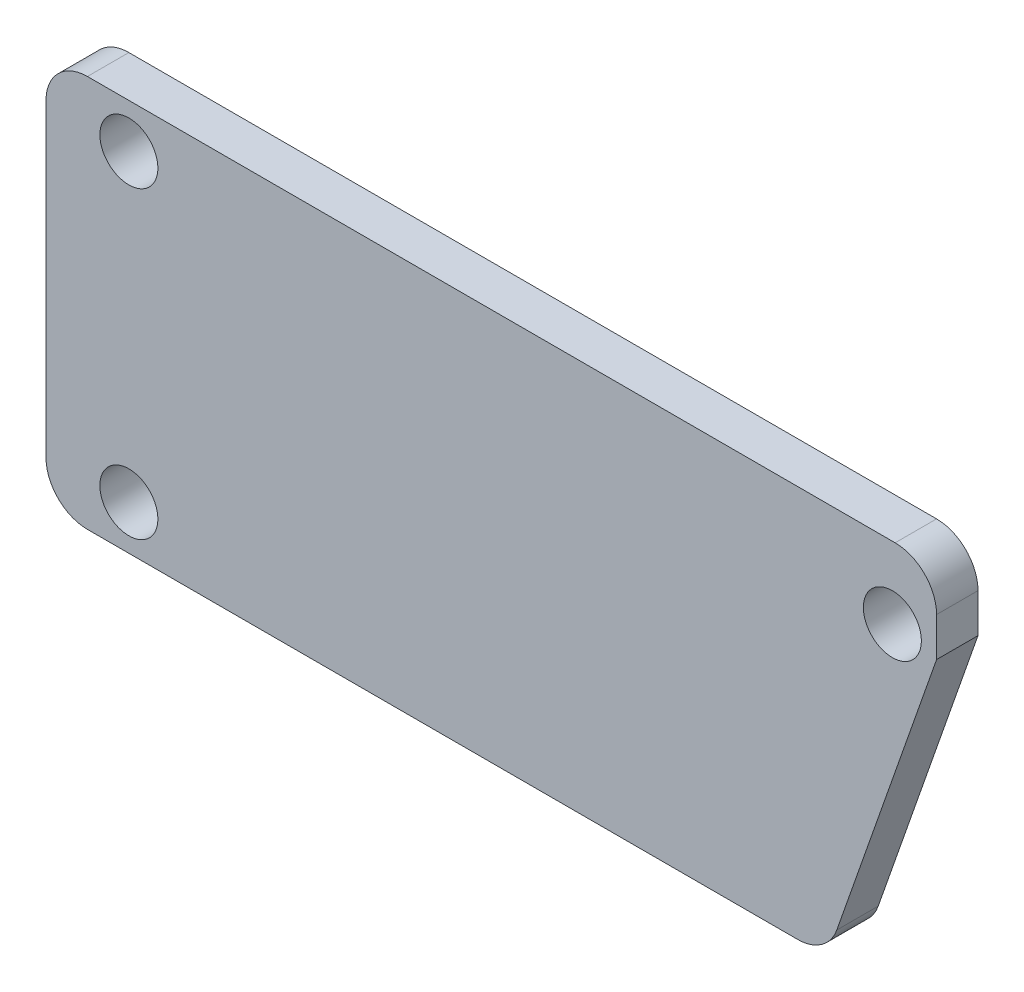
ISO-10303-21;
HEADER;
FILE_DESCRIPTION(('STEP AP214'),'2;1');
FILE_NAME('part.step','',(''),(''),'','','');
FILE_SCHEMA(('AUTOMOTIVE_DESIGN { 1 0 10303 214 1 1 1 1 }'));
ENDSEC;
DATA;
#1=APPLICATION_CONTEXT('core data for automotive mechanical design processes');
#2=APPLICATION_PROTOCOL_DEFINITION('international standard','automotive_design',2000,#1);
#3=PRODUCT_CONTEXT('',#1,'mechanical');
#4=PRODUCT('Part','Part','',(#3));
#5=PRODUCT_RELATED_PRODUCT_CATEGORY('part','',(#4));
#6=PRODUCT_DEFINITION_FORMATION('','',#4);
#7=PRODUCT_DEFINITION_CONTEXT('part definition',#1,'design');
#8=PRODUCT_DEFINITION('design','',#6,#7);
#9=PRODUCT_DEFINITION_SHAPE('','',#8);
#10=(LENGTH_UNIT() NAMED_UNIT(*) SI_UNIT(.MILLI.,.METRE.));
#11=(NAMED_UNIT(*) PLANE_ANGLE_UNIT() SI_UNIT($,.RADIAN.));
#12=(NAMED_UNIT(*) SI_UNIT($,.STERADIAN.) SOLID_ANGLE_UNIT());
#13=UNCERTAINTY_MEASURE_WITH_UNIT(LENGTH_MEASURE(1.E-05),#10,'distance_accuracy_value','');
#14=(GEOMETRIC_REPRESENTATION_CONTEXT(3) GLOBAL_UNCERTAINTY_ASSIGNED_CONTEXT((#13)) GLOBAL_UNIT_ASSIGNED_CONTEXT((#10,
#11,#12)) REPRESENTATION_CONTEXT('',''));
#15=CARTESIAN_POINT('',(0.,0.,0.));
#16=DIRECTION('',(0.,0.,1.));
#17=DIRECTION('',(1.,0.,0.));
#18=AXIS2_PLACEMENT_3D('',#15,#16,#17);
#19=CARTESIAN_POINT('',(0.,0.,0.));
#20=DIRECTION('',(0.,0.,1.));
#21=DIRECTION('',(1.,0.,0.));
#22=AXIS2_PLACEMENT_3D('',#19,#20,#21);
#23=PLANE('',#22);
#24=CARTESIAN_POINT('',(21.6878260869565,5.61253324212658,0.));
#25=DIRECTION('',(0.,0.,1.));
#26=DIRECTION('',(1.,0.,0.));
#27=AXIS2_PLACEMENT_3D('',#24,#25,#26);
#28=CIRCLE('',#27,1.05);
#29=CARTESIAN_POINT('',(22.7378260869565,5.61253324212658,0.));
#30=VERTEX_POINT('',#29);
#31=EDGE_CURVE('E148',#30,#30,#28,.T.);
#32=ORIENTED_EDGE('',*,*,#31,.T.);
#33=EDGE_LOOP('',(#32));
#34=FACE_BOUND('',#33,.T.);
#35=CARTESIAN_POINT('',(-5.95217391304348,6.61253324212658,0.));
#36=DIRECTION('',(0.,0.,1.));
#37=DIRECTION('',(-1.,0.,0.));
#38=AXIS2_PLACEMENT_3D('',#35,#36,#37);
#39=CIRCLE('',#38,1.05);
#40=CARTESIAN_POINT('',(-7.00217391304348,6.61253324212658,0.));
#41=VERTEX_POINT('',#40);
#42=EDGE_CURVE('E158',#41,#41,#39,.T.);
#43=ORIENTED_EDGE('',*,*,#42,.T.);
#44=EDGE_LOOP('',(#43));
#45=FACE_BOUND('',#44,.T.);
#46=CARTESIAN_POINT('',(-5.95217391304348,-4.38746675787342,0.));
#47=DIRECTION('',(0.,0.,1.));
#48=DIRECTION('',(1.,0.,0.));
#49=AXIS2_PLACEMENT_3D('',#46,#47,#48);
#50=CIRCLE('',#49,1.05);
#51=CARTESIAN_POINT('',(-4.90217391304348,-4.38746675787342,0.));
#52=VERTEX_POINT('',#51);
#53=EDGE_CURVE('E163',#52,#52,#50,.T.);
#54=ORIENTED_EDGE('',*,*,#53,.T.);
#55=EDGE_LOOP('',(#54));
#56=FACE_BOUND('',#55,.T.);
#57=DIRECTION('',(0.331357070773526,0.943505427461013,0.));
#58=VECTOR('',#57,1.);
#59=CARTESIAN_POINT('',(19.3231466399224,-5.98746675787342,0.));
#60=LINE('',#59,#58);
#61=CARTESIAN_POINT('',(19.675385571422,-4.98450236403371,0.));
#62=VERTEX_POINT('',#61);
#63=CARTESIAN_POINT('',(23.2878260869565,5.30155317366882,0.));
#64=VERTEX_POINT('',#63);
#65=EDGE_CURVE('E193',#62,#64,#60,.T.);
#66=ORIENTED_EDGE('',*,*,#65,.F.);
#67=CARTESIAN_POINT('',(18.2601274302304,-4.48746675787342,0.));
#68=DIRECTION('',(0.,0.,1.));
#69=DIRECTION('',(1.,0.,0.));
#70=AXIS2_PLACEMENT_3D('',#67,#68,#69);
#71=CIRCLE('',#70,1.5);
#72=CARTESIAN_POINT('',(18.2601274302304,-5.98746675787342,0.));
#73=VERTEX_POINT('',#72);
#74=EDGE_CURVE('E218',#62,#73,#71,.F.);
#75=ORIENTED_EDGE('',*,*,#74,.T.);
#76=DIRECTION('',(1.,0.,0.));
#77=VECTOR('',#76,1.);
#78=CARTESIAN_POINT('',(-8.95217391304348,-5.98746675787342,0.));
#79=LINE('',#78,#77);
#80=CARTESIAN_POINT('',(-7.45217391304348,-5.98746675787342,0.));
#81=VERTEX_POINT('',#80);
#82=EDGE_CURVE('E190',#81,#73,#79,.T.);
#83=ORIENTED_EDGE('',*,*,#82,.F.);
#84=CARTESIAN_POINT('',(-7.45217391304348,-4.48746675787342,0.));
#85=DIRECTION('',(0.,0.,1.));
#86=DIRECTION('',(1.,0.,0.));
#87=AXIS2_PLACEMENT_3D('',#84,#85,#86);
#88=CIRCLE('',#87,1.5);
#89=CARTESIAN_POINT('',(-8.95217391304348,-4.48746675787342,0.));
#90=VERTEX_POINT('',#89);
#91=EDGE_CURVE('E216',#81,#90,#88,.F.);
#92=ORIENTED_EDGE('',*,*,#91,.T.);
#93=DIRECTION('',(0.,-1.,0.));
#94=VECTOR('',#93,1.);
#95=CARTESIAN_POINT('',(-8.95217391304348,8.21253324212658,0.));
#96=LINE('',#95,#94);
#97=CARTESIAN_POINT('',(-8.95217391304348,6.71253324212658,0.));
#98=VERTEX_POINT('',#97);
#99=EDGE_CURVE('E169',#98,#90,#96,.T.);
#100=ORIENTED_EDGE('',*,*,#99,.F.);
#101=CARTESIAN_POINT('',(-7.45217391304348,6.71253324212658,0.));
#102=DIRECTION('',(0.,0.,1.));
#103=DIRECTION('',(1.,0.,0.));
#104=AXIS2_PLACEMENT_3D('',#101,#102,#103);
#105=CIRCLE('',#104,1.5);
#106=CARTESIAN_POINT('',(-7.45217391304348,8.21253324212658,0.));
#107=VERTEX_POINT('',#106);
#108=EDGE_CURVE('E214',#98,#107,#105,.F.);
#109=ORIENTED_EDGE('',*,*,#108,.T.);
#110=DIRECTION('',(-1.,0.,0.));
#111=VECTOR('',#110,1.);
#112=CARTESIAN_POINT('',(-8.95217391304348,8.21253324212658,0.));
#113=LINE('',#112,#111);
#114=CARTESIAN_POINT('',(21.7878260869565,8.21253324212658,0.));
#115=VERTEX_POINT('',#114);
#116=EDGE_CURVE('E176',#115,#107,#113,.T.);
#117=ORIENTED_EDGE('',*,*,#116,.F.);
#118=CARTESIAN_POINT('',(21.7878260869565,6.71253324212658,0.));
#119=DIRECTION('',(0.,0.,1.));
#120=DIRECTION('',(1.,0.,0.));
#121=AXIS2_PLACEMENT_3D('',#118,#119,#120);
#122=CIRCLE('',#121,1.5);
#123=CARTESIAN_POINT('',(23.2878260869565,6.71253324212658,0.));
#124=VERTEX_POINT('',#123);
#125=EDGE_CURVE('E205',#115,#124,#122,.F.);
#126=ORIENTED_EDGE('',*,*,#125,.T.);
#127=DIRECTION('',(0.,1.,0.));
#128=VECTOR('',#127,1.);
#129=CARTESIAN_POINT('',(23.2878260869565,8.21253324212658,0.));
#130=LINE('',#129,#128);
#131=EDGE_CURVE('E195',#64,#124,#130,.T.);
#132=ORIENTED_EDGE('',*,*,#131,.F.);
#133=EDGE_LOOP('',(#66,#75,#83,#92,#100,#109,#117,#126,#132));
#134=FACE_BOUND('',#133,.T.);
#135=DIRECTION('',(0.,-1.,0.));
#136=VECTOR('',#135,1.);
#137=CARTESIAN_POINT('',(5.20782608695652,2.36253324212658,0.));
#138=LINE('',#137,#136);
#139=CARTESIAN_POINT('',(5.20782608695652,2.36253324212658,0.));
#140=VERTEX_POINT('',#139);
#141=CARTESIAN_POINT('',(5.20782608695652,-0.137466757873424,0.));
#142=VERTEX_POINT('',#141);
#143=EDGE_CURVE('E147',#140,#142,#138,.T.);
#144=ORIENTED_EDGE('',*,*,#143,.F.);
#145=DIRECTION('',(1.,0.,0.));
#146=VECTOR('',#145,1.);
#147=CARTESIAN_POINT('',(5.20782608695652,2.36253324212658,0.));
#148=LINE('',#147,#146);
#149=CARTESIAN_POINT('',(2.70782608695652,2.36253324212658,0.));
#150=VERTEX_POINT('',#149);
#151=EDGE_CURVE('E144',#150,#140,#148,.T.);
#152=ORIENTED_EDGE('',*,*,#151,.F.);
#153=DIRECTION('',(0.,1.,0.));
#154=VECTOR('',#153,1.);
#155=CARTESIAN_POINT('',(2.70782608695652,2.36253324212658,0.));
#156=LINE('',#155,#154);
#157=CARTESIAN_POINT('',(2.70782608695652,-0.137466757873423,0.));
#158=VERTEX_POINT('',#157);
#159=EDGE_CURVE('E53',#158,#150,#156,.T.);
#160=ORIENTED_EDGE('',*,*,#159,.F.);
#161=DIRECTION('',(-1.,0.,0.));
#162=VECTOR('',#161,1.);
#163=CARTESIAN_POINT('',(5.20782608695652,-0.137466757873424,0.));
#164=LINE('',#163,#162);
#165=EDGE_CURVE('E48',#142,#158,#164,.T.);
#166=ORIENTED_EDGE('',*,*,#165,.F.);
#167=EDGE_LOOP('',(#144,#152,#160,#166));
#168=FACE_BOUND('',#167,.T.);
#169=ADVANCED_FACE('F33',(#34,#45,#56,#134,#168),#23,.F.);
#170=CARTESIAN_POINT('',(0.,0.,1.5));
#171=DIRECTION('',(0.,0.,1.));
#172=DIRECTION('',(1.,0.,0.));
#173=AXIS2_PLACEMENT_3D('',#170,#171,#172);
#174=PLANE('',#173);
#175=CARTESIAN_POINT('',(-5.95217391304348,6.61253324212658,1.5));
#176=DIRECTION('',(0.,0.,1.));
#177=DIRECTION('',(-1.,0.,0.));
#178=AXIS2_PLACEMENT_3D('',#175,#176,#177);
#179=CIRCLE('',#178,1.05);
#180=CARTESIAN_POINT('',(-7.00217391304348,6.61253324212658,1.5));
#181=VERTEX_POINT('',#180);
#182=EDGE_CURVE('E160',#181,#181,#179,.T.);
#183=ORIENTED_EDGE('',*,*,#182,.F.);
#184=EDGE_LOOP('',(#183));
#185=FACE_BOUND('',#184,.T.);
#186=DIRECTION('',(1.,0.,0.));
#187=VECTOR('',#186,1.);
#188=CARTESIAN_POINT('',(-8.95217391304348,-5.98746675787342,1.5));
#189=LINE('',#188,#187);
#190=CARTESIAN_POINT('',(-7.45217391304348,-5.98746675787342,1.5));
#191=VERTEX_POINT('',#190);
#192=CARTESIAN_POINT('',(18.2601274302304,-5.98746675787342,1.5));
#193=VERTEX_POINT('',#192);
#194=EDGE_CURVE('E175',#191,#193,#189,.T.);
#195=ORIENTED_EDGE('',*,*,#194,.T.);
#196=CARTESIAN_POINT('',(18.2601274302304,-4.48746675787342,1.5));
#197=DIRECTION('',(0.,0.,1.));
#198=DIRECTION('',(1.,0.,0.));
#199=AXIS2_PLACEMENT_3D('',#196,#197,#198);
#200=CIRCLE('',#199,1.5);
#201=CARTESIAN_POINT('',(19.675385571422,-4.98450236403371,1.5));
#202=VERTEX_POINT('',#201);
#203=EDGE_CURVE('E229',#193,#202,#200,.T.);
#204=ORIENTED_EDGE('',*,*,#203,.T.);
#205=DIRECTION('',(0.331357070773526,0.943505427461013,0.));
#206=VECTOR('',#205,1.);
#207=CARTESIAN_POINT('',(19.3231466399224,-5.98746675787342,1.5));
#208=LINE('',#207,#206);
#209=CARTESIAN_POINT('',(23.2878260869565,5.30155317366882,1.5));
#210=VERTEX_POINT('',#209);
#211=EDGE_CURVE('E179',#202,#210,#208,.T.);
#212=ORIENTED_EDGE('',*,*,#211,.T.);
#213=DIRECTION('',(0.,1.,0.));
#214=VECTOR('',#213,1.);
#215=CARTESIAN_POINT('',(23.2878260869565,8.21253324212658,1.5));
#216=LINE('',#215,#214);
#217=CARTESIAN_POINT('',(23.2878260869565,6.71253324212658,1.5));
#218=VERTEX_POINT('',#217);
#219=EDGE_CURVE('E181',#210,#218,#216,.T.);
#220=ORIENTED_EDGE('',*,*,#219,.T.);
#221=CARTESIAN_POINT('',(21.7878260869565,6.71253324212658,1.5));
#222=DIRECTION('',(0.,0.,1.));
#223=DIRECTION('',(1.,0.,0.));
#224=AXIS2_PLACEMENT_3D('',#221,#222,#223);
#225=CIRCLE('',#224,1.5);
#226=CARTESIAN_POINT('',(21.7878260869565,8.21253324212658,1.5));
#227=VERTEX_POINT('',#226);
#228=EDGE_CURVE('E209',#218,#227,#225,.T.);
#229=ORIENTED_EDGE('',*,*,#228,.T.);
#230=DIRECTION('',(-1.,0.,0.));
#231=VECTOR('',#230,1.);
#232=CARTESIAN_POINT('',(-8.95217391304348,8.21253324212658,1.5));
#233=LINE('',#232,#231);
#234=CARTESIAN_POINT('',(-7.45217391304348,8.21253324212658,1.5));
#235=VERTEX_POINT('',#234);
#236=EDGE_CURVE('E184',#227,#235,#233,.T.);
#237=ORIENTED_EDGE('',*,*,#236,.T.);
#238=CARTESIAN_POINT('',(-7.45217391304348,6.71253324212658,1.5));
#239=DIRECTION('',(0.,0.,1.));
#240=DIRECTION('',(1.,0.,0.));
#241=AXIS2_PLACEMENT_3D('',#238,#239,#240);
#242=CIRCLE('',#241,1.5);
#243=CARTESIAN_POINT('',(-8.95217391304348,6.71253324212658,1.5));
#244=VERTEX_POINT('',#243);
#245=EDGE_CURVE('E225',#235,#244,#242,.T.);
#246=ORIENTED_EDGE('',*,*,#245,.T.);
#247=DIRECTION('',(0.,-1.,0.));
#248=VECTOR('',#247,1.);
#249=CARTESIAN_POINT('',(-8.95217391304348,8.21253324212658,1.5));
#250=LINE('',#249,#248);
#251=CARTESIAN_POINT('',(-8.95217391304348,-4.48746675787342,1.5));
#252=VERTEX_POINT('',#251);
#253=EDGE_CURVE('E172',#244,#252,#250,.T.);
#254=ORIENTED_EDGE('',*,*,#253,.T.);
#255=CARTESIAN_POINT('',(-7.45217391304348,-4.48746675787342,1.5));
#256=DIRECTION('',(0.,0.,1.));
#257=DIRECTION('',(1.,0.,0.));
#258=AXIS2_PLACEMENT_3D('',#255,#256,#257);
#259=CIRCLE('',#258,1.5);
#260=EDGE_CURVE('E227',#252,#191,#259,.T.);
#261=ORIENTED_EDGE('',*,*,#260,.T.);
#262=EDGE_LOOP('',(#195,#204,#212,#220,#229,#237,#246,#254,#261));
#263=FACE_BOUND('',#262,.T.);
#264=CARTESIAN_POINT('',(-5.95217391304348,-4.38746675787342,1.5));
#265=DIRECTION('',(0.,0.,1.));
#266=DIRECTION('',(1.,0.,0.));
#267=AXIS2_PLACEMENT_3D('',#264,#265,#266);
#268=CIRCLE('',#267,1.05);
#269=CARTESIAN_POINT('',(-4.90217391304348,-4.38746675787342,1.5));
#270=VERTEX_POINT('',#269);
#271=EDGE_CURVE('E166',#270,#270,#268,.T.);
#272=ORIENTED_EDGE('',*,*,#271,.F.);
#273=EDGE_LOOP('',(#272));
#274=FACE_BOUND('',#273,.T.);
#275=CARTESIAN_POINT('',(21.6878260869565,5.61253324212658,1.5));
#276=DIRECTION('',(0.,0.,1.));
#277=DIRECTION('',(1.,0.,0.));
#278=AXIS2_PLACEMENT_3D('',#275,#276,#277);
#279=CIRCLE('',#278,1.05);
#280=CARTESIAN_POINT('',(22.7378260869565,5.61253324212658,1.5));
#281=VERTEX_POINT('',#280);
#282=EDGE_CURVE('E151',#281,#281,#279,.T.);
#283=ORIENTED_EDGE('',*,*,#282,.F.);
#284=EDGE_LOOP('',(#283));
#285=FACE_BOUND('',#284,.T.);
#286=ADVANCED_FACE('F242',(#185,#263,#274,#285),#174,.T.);
#287=CARTESIAN_POINT('',(-8.95217391304348,8.21253324212658,1.5));
#288=DIRECTION('',(1.,0.,0.));
#289=DIRECTION('',(0.,0.,-1.));
#290=AXIS2_PLACEMENT_3D('',#287,#288,#289);
#291=PLANE('',#290);
#292=ORIENTED_EDGE('',*,*,#99,.T.);
#293=DIRECTION('',(0.,0.,-1.));
#294=VECTOR('',#293,1.);
#295=CARTESIAN_POINT('',(-8.95217391304348,-4.48746675787342,1.5));
#296=LINE('',#295,#294);
#297=EDGE_CURVE('E41',#90,#252,#296,.F.);
#298=ORIENTED_EDGE('',*,*,#297,.T.);
#299=ORIENTED_EDGE('',*,*,#253,.F.);
#300=DIRECTION('',(0.,0.,-1.));
#301=VECTOR('',#300,1.);
#302=CARTESIAN_POINT('',(-8.95217391304348,6.71253324212658,1.5));
#303=LINE('',#302,#301);
#304=EDGE_CURVE('E231',#244,#98,#303,.T.);
#305=ORIENTED_EDGE('',*,*,#304,.T.);
#306=EDGE_LOOP('',(#292,#298,#299,#305));
#307=FACE_BOUND('',#306,.T.);
#308=ADVANCED_FACE('F236',(#307),#291,.F.);
#309=CARTESIAN_POINT('',(-8.95217391304348,-5.98746675787342,1.5));
#310=DIRECTION('',(0.,1.,0.));
#311=DIRECTION('',(0.,0.,1.));
#312=AXIS2_PLACEMENT_3D('',#309,#310,#311);
#313=PLANE('',#312);
#314=ORIENTED_EDGE('',*,*,#82,.T.);
#315=DIRECTION('',(0.,0.,-1.));
#316=VECTOR('',#315,1.);
#317=CARTESIAN_POINT('',(18.2601274302304,-5.98746675787342,1.5));
#318=LINE('',#317,#316);
#319=EDGE_CURVE('E223',#73,#193,#318,.F.);
#320=ORIENTED_EDGE('',*,*,#319,.T.);
#321=ORIENTED_EDGE('',*,*,#194,.F.);
#322=DIRECTION('',(0.,0.,-1.));
#323=VECTOR('',#322,1.);
#324=CARTESIAN_POINT('',(-7.45217391304348,-5.98746675787342,1.5));
#325=LINE('',#324,#323);
#326=EDGE_CURVE('E220',#191,#81,#325,.T.);
#327=ORIENTED_EDGE('',*,*,#326,.T.);
#328=EDGE_LOOP('',(#314,#320,#321,#327));
#329=FACE_BOUND('',#328,.T.);
#330=ADVANCED_FACE('F250',(#329),#313,.F.);
#331=CARTESIAN_POINT('',(19.3231466399224,-5.98746675787342,1.5));
#332=DIRECTION('',(-0.943505427461013,0.331357070773526,0.));
#333=DIRECTION('',(-0.331357070773526,-0.943505427461013,0.));
#334=AXIS2_PLACEMENT_3D('',#331,#332,#333);
#335=PLANE('',#334);
#336=ORIENTED_EDGE('',*,*,#211,.F.);
#337=DIRECTION('',(0.,0.,-1.));
#338=VECTOR('',#337,1.);
#339=CARTESIAN_POINT('',(19.675385571422,-4.98450236403371,1.5));
#340=LINE('',#339,#338);
#341=EDGE_CURVE('E211',#202,#62,#340,.T.);
#342=ORIENTED_EDGE('',*,*,#341,.T.);
#343=ORIENTED_EDGE('',*,*,#65,.T.);
#344=DIRECTION('',(0.,0.,-1.));
#345=VECTOR('',#344,1.);
#346=CARTESIAN_POINT('',(23.2878260869565,5.30155317366882,1.5));
#347=LINE('',#346,#345);
#348=EDGE_CURVE('E187',#210,#64,#347,.T.);
#349=ORIENTED_EDGE('',*,*,#348,.F.);
#350=EDGE_LOOP('',(#336,#342,#343,#349));
#351=FACE_BOUND('',#350,.T.);
#352=ADVANCED_FACE('F261',(#351),#335,.F.);
#353=CARTESIAN_POINT('',(23.2878260869565,8.21253324212658,1.5));
#354=DIRECTION('',(-1.,0.,0.));
#355=DIRECTION('',(0.,-1.,0.));
#356=AXIS2_PLACEMENT_3D('',#353,#354,#355);
#357=PLANE('',#356);
#358=ORIENTED_EDGE('',*,*,#131,.T.);
#359=DIRECTION('',(0.,0.,-1.));
#360=VECTOR('',#359,1.);
#361=CARTESIAN_POINT('',(23.2878260869565,6.71253324212658,1.5));
#362=LINE('',#361,#360);
#363=EDGE_CURVE('E207',#124,#218,#362,.F.);
#364=ORIENTED_EDGE('',*,*,#363,.T.);
#365=ORIENTED_EDGE('',*,*,#219,.F.);
#366=ORIENTED_EDGE('',*,*,#348,.T.);
#367=EDGE_LOOP('',(#358,#364,#365,#366));
#368=FACE_BOUND('',#367,.T.);
#369=ADVANCED_FACE('F296',(#368),#357,.F.);
#370=CARTESIAN_POINT('',(-8.95217391304348,8.21253324212658,1.5));
#371=DIRECTION('',(0.,-1.,0.));
#372=DIRECTION('',(0.,0.,-1.));
#373=AXIS2_PLACEMENT_3D('',#370,#371,#372);
#374=PLANE('',#373);
#375=ORIENTED_EDGE('',*,*,#116,.T.);
#376=DIRECTION('',(0.,0.,-1.));
#377=VECTOR('',#376,1.);
#378=CARTESIAN_POINT('',(-7.45217391304348,8.21253324212658,1.5));
#379=LINE('',#378,#377);
#380=EDGE_CURVE('E11',#107,#235,#379,.F.);
#381=ORIENTED_EDGE('',*,*,#380,.T.);
#382=ORIENTED_EDGE('',*,*,#236,.F.);
#383=DIRECTION('',(0.,0.,-1.));
#384=VECTOR('',#383,1.);
#385=CARTESIAN_POINT('',(21.7878260869565,8.21253324212658,1.5));
#386=LINE('',#385,#384);
#387=EDGE_CURVE('E202',#227,#115,#386,.T.);
#388=ORIENTED_EDGE('',*,*,#387,.T.);
#389=EDGE_LOOP('',(#375,#381,#382,#388));
#390=FACE_BOUND('',#389,.T.);
#391=ADVANCED_FACE('F273',(#390),#374,.F.);
#392=CARTESIAN_POINT('',(-5.95217391304348,-4.38746675787342,1.5));
#393=DIRECTION('',(0.,0.,-1.));
#394=DIRECTION('',(-1.,0.,0.));
#395=AXIS2_PLACEMENT_3D('',#392,#393,#394);
#396=CYLINDRICAL_SURFACE('',#395,1.05);
#397=ORIENTED_EDGE('',*,*,#271,.T.);
#398=EDGE_LOOP('',(#397));
#399=FACE_BOUND('',#398,.T.);
#400=ORIENTED_EDGE('',*,*,#53,.F.);
#401=EDGE_LOOP('',(#400));
#402=FACE_BOUND('',#401,.T.);
#403=ADVANCED_FACE('F295',(#399,#402),#396,.F.);
#404=CARTESIAN_POINT('',(-5.95217391304348,6.61253324212658,1.5));
#405=DIRECTION('',(0.,0.,-1.));
#406=DIRECTION('',(-1.,0.,0.));
#407=AXIS2_PLACEMENT_3D('',#404,#405,#406);
#408=CYLINDRICAL_SURFACE('',#407,1.05);
#409=ORIENTED_EDGE('',*,*,#182,.T.);
#410=EDGE_LOOP('',(#409));
#411=FACE_BOUND('',#410,.T.);
#412=ORIENTED_EDGE('',*,*,#42,.F.);
#413=EDGE_LOOP('',(#412));
#414=FACE_BOUND('',#413,.T.);
#415=ADVANCED_FACE('F375',(#411,#414),#408,.F.);
#416=CARTESIAN_POINT('',(21.6878260869565,5.61253324212658,1.5));
#417=DIRECTION('',(0.,0.,-1.));
#418=DIRECTION('',(-1.,0.,0.));
#419=AXIS2_PLACEMENT_3D('',#416,#417,#418);
#420=CYLINDRICAL_SURFACE('',#419,1.05);
#421=ORIENTED_EDGE('',*,*,#282,.T.);
#422=EDGE_LOOP('',(#421));
#423=FACE_BOUND('',#422,.T.);
#424=ORIENTED_EDGE('',*,*,#31,.F.);
#425=EDGE_LOOP('',(#424));
#426=FACE_BOUND('',#425,.T.);
#427=ADVANCED_FACE('F307',(#423,#426),#420,.F.);
#428=CARTESIAN_POINT('',(21.7878260869565,6.71253324212658,1.5));
#429=DIRECTION('',(0.,0.,-1.));
#430=DIRECTION('',(-1.,0.,0.));
#431=AXIS2_PLACEMENT_3D('',#428,#429,#430);
#432=CYLINDRICAL_SURFACE('',#431,1.5);
#433=ORIENTED_EDGE('',*,*,#228,.F.);
#434=ORIENTED_EDGE('',*,*,#363,.F.);
#435=ORIENTED_EDGE('',*,*,#125,.F.);
#436=ORIENTED_EDGE('',*,*,#387,.F.);
#437=EDGE_LOOP('',(#433,#434,#435,#436));
#438=FACE_BOUND('',#437,.T.);
#439=ADVANCED_FACE('F270',(#438),#432,.T.);
#440=CARTESIAN_POINT('',(18.2601274302304,-4.48746675787342,1.5));
#441=DIRECTION('',(0.,0.,-1.));
#442=DIRECTION('',(-1.,0.,0.));
#443=AXIS2_PLACEMENT_3D('',#440,#441,#442);
#444=CYLINDRICAL_SURFACE('',#443,1.5);
#445=ORIENTED_EDGE('',*,*,#203,.F.);
#446=ORIENTED_EDGE('',*,*,#319,.F.);
#447=ORIENTED_EDGE('',*,*,#74,.F.);
#448=ORIENTED_EDGE('',*,*,#341,.F.);
#449=EDGE_LOOP('',(#445,#446,#447,#448));
#450=FACE_BOUND('',#449,.T.);
#451=ADVANCED_FACE('F258',(#450),#444,.T.);
#452=CARTESIAN_POINT('',(-7.45217391304348,-4.48746675787342,1.5));
#453=DIRECTION('',(0.,0.,-1.));
#454=DIRECTION('',(-1.,0.,0.));
#455=AXIS2_PLACEMENT_3D('',#452,#453,#454);
#456=CYLINDRICAL_SURFACE('',#455,1.5);
#457=ORIENTED_EDGE('',*,*,#260,.F.);
#458=ORIENTED_EDGE('',*,*,#297,.F.);
#459=ORIENTED_EDGE('',*,*,#91,.F.);
#460=ORIENTED_EDGE('',*,*,#326,.F.);
#461=EDGE_LOOP('',(#457,#458,#459,#460));
#462=FACE_BOUND('',#461,.T.);
#463=ADVANCED_FACE('F247',(#462),#456,.T.);
#464=CARTESIAN_POINT('',(-7.45217391304348,6.71253324212658,1.5));
#465=DIRECTION('',(0.,0.,-1.));
#466=DIRECTION('',(-1.,0.,0.));
#467=AXIS2_PLACEMENT_3D('',#464,#465,#466);
#468=CYLINDRICAL_SURFACE('',#467,1.5);
#469=ORIENTED_EDGE('',*,*,#245,.F.);
#470=ORIENTED_EDGE('',*,*,#380,.F.);
#471=ORIENTED_EDGE('',*,*,#108,.F.);
#472=ORIENTED_EDGE('',*,*,#304,.F.);
#473=EDGE_LOOP('',(#469,#470,#471,#472));
#474=FACE_BOUND('',#473,.T.);
#475=ADVANCED_FACE('F35',(#474),#468,.T.);
#476=CARTESIAN_POINT('',(5.20782608695652,2.36253324212658,-2.));
#477=DIRECTION('',(-1.,0.,0.));
#478=DIRECTION('',(0.,0.,1.));
#479=AXIS2_PLACEMENT_3D('',#476,#477,#478);
#480=PLANE('',#479);
#481=ORIENTED_EDGE('',*,*,#143,.T.);
#482=DIRECTION('',(0.,0.,1.));
#483=VECTOR('',#482,1.);
#484=CARTESIAN_POINT('',(5.20782608695652,-0.137466757873424,-2.));
#485=LINE('',#484,#483);
#486=CARTESIAN_POINT('',(5.20782608695652,-0.137466757873424,-2.));
#487=VERTEX_POINT('',#486);
#488=EDGE_CURVE('E128',#487,#142,#485,.T.);
#489=ORIENTED_EDGE('',*,*,#488,.F.);
#490=DIRECTION('',(0.,-1.,0.));
#491=VECTOR('',#490,1.);
#492=CARTESIAN_POINT('',(5.20782608695652,2.36253324212658,-2.));
#493=LINE('',#492,#491);
#494=CARTESIAN_POINT('',(5.20782608695652,2.36253324212658,-2.));
#495=VERTEX_POINT('',#494);
#496=EDGE_CURVE('E135',#495,#487,#493,.T.);
#497=ORIENTED_EDGE('',*,*,#496,.F.);
#498=DIRECTION('',(0.,0.,1.));
#499=VECTOR('',#498,1.);
#500=CARTESIAN_POINT('',(5.20782608695652,2.36253324212658,-2.));
#501=LINE('',#500,#499);
#502=EDGE_CURVE('E453',#495,#140,#501,.T.);
#503=ORIENTED_EDGE('',*,*,#502,.T.);
#504=EDGE_LOOP('',(#481,#489,#497,#503));
#505=FACE_BOUND('',#504,.T.);
#506=ADVANCED_FACE('F146',(#505),#480,.F.);
#507=CARTESIAN_POINT('',(5.20782608695652,-0.137466757873424,-2.));
#508=DIRECTION('',(0.,1.,0.));
#509=DIRECTION('',(-1.,0.,0.));
#510=AXIS2_PLACEMENT_3D('',#507,#508,#509);
#511=PLANE('',#510);
#512=ORIENTED_EDGE('',*,*,#165,.T.);
#513=DIRECTION('',(0.,0.,1.));
#514=VECTOR('',#513,1.);
#515=CARTESIAN_POINT('',(2.70782608695652,-0.137466757873423,-2.));
#516=LINE('',#515,#514);
#517=CARTESIAN_POINT('',(2.70782608695652,-0.137466757873423,-2.));
#518=VERTEX_POINT('',#517);
#519=EDGE_CURVE('E131',#518,#158,#516,.T.);
#520=ORIENTED_EDGE('',*,*,#519,.F.);
#521=DIRECTION('',(-1.,0.,0.));
#522=VECTOR('',#521,1.);
#523=CARTESIAN_POINT('',(5.20782608695652,-0.137466757873424,-2.));
#524=LINE('',#523,#522);
#525=EDGE_CURVE('E124',#487,#518,#524,.T.);
#526=ORIENTED_EDGE('',*,*,#525,.F.);
#527=ORIENTED_EDGE('',*,*,#488,.T.);
#528=EDGE_LOOP('',(#512,#520,#526,#527));
#529=FACE_BOUND('',#528,.T.);
#530=ADVANCED_FACE('F126',(#529),#511,.F.);
#531=CARTESIAN_POINT('',(2.70782608695652,2.36253324212658,-2.));
#532=DIRECTION('',(1.,0.,0.));
#533=DIRECTION('',(0.,0.,-1.));
#534=AXIS2_PLACEMENT_3D('',#531,#532,#533);
#535=PLANE('',#534);
#536=ORIENTED_EDGE('',*,*,#159,.T.);
#537=DIRECTION('',(0.,0.,1.));
#538=VECTOR('',#537,1.);
#539=CARTESIAN_POINT('',(2.70782608695652,2.36253324212658,-2.));
#540=LINE('',#539,#538);
#541=CARTESIAN_POINT('',(2.70782608695652,2.36253324212658,-2.));
#542=VERTEX_POINT('',#541);
#543=EDGE_CURVE('E153',#542,#150,#540,.T.);
#544=ORIENTED_EDGE('',*,*,#543,.F.);
#545=DIRECTION('',(0.,1.,0.));
#546=VECTOR('',#545,1.);
#547=CARTESIAN_POINT('',(2.70782608695652,2.36253324212658,-2.));
#548=LINE('',#547,#546);
#549=EDGE_CURVE('E134',#518,#542,#548,.T.);
#550=ORIENTED_EDGE('',*,*,#549,.F.);
#551=ORIENTED_EDGE('',*,*,#519,.T.);
#552=EDGE_LOOP('',(#536,#544,#550,#551));
#553=FACE_BOUND('',#552,.T.);
#554=ADVANCED_FACE('F342',(#553),#535,.F.);
#555=CARTESIAN_POINT('',(5.20782608695652,2.36253324212658,-2.));
#556=DIRECTION('',(0.,-1.,0.));
#557=DIRECTION('',(1.,0.,0.));
#558=AXIS2_PLACEMENT_3D('',#555,#556,#557);
#559=PLANE('',#558);
#560=ORIENTED_EDGE('',*,*,#151,.T.);
#561=ORIENTED_EDGE('',*,*,#502,.F.);
#562=DIRECTION('',(1.,0.,0.));
#563=VECTOR('',#562,1.);
#564=CARTESIAN_POINT('',(5.20782608695652,2.36253324212658,-2.));
#565=LINE('',#564,#563);
#566=EDGE_CURVE('E140',#542,#495,#565,.T.);
#567=ORIENTED_EDGE('',*,*,#566,.F.);
#568=ORIENTED_EDGE('',*,*,#543,.T.);
#569=EDGE_LOOP('',(#560,#561,#567,#568));
#570=FACE_BOUND('',#569,.T.);
#571=ADVANCED_FACE('F351',(#570),#559,.F.);
#572=CARTESIAN_POINT('',(0.,0.,-2.));
#573=DIRECTION('',(0.,0.,-1.));
#574=DIRECTION('',(-1.,0.,0.));
#575=AXIS2_PLACEMENT_3D('',#572,#573,#574);
#576=PLANE('',#575);
#577=ORIENTED_EDGE('',*,*,#496,.T.);
#578=ORIENTED_EDGE('',*,*,#525,.T.);
#579=ORIENTED_EDGE('',*,*,#549,.T.);
#580=ORIENTED_EDGE('',*,*,#566,.T.);
#581=EDGE_LOOP('',(#577,#578,#579,#580));
#582=FACE_BOUND('',#581,.T.);
#583=ADVANCED_FACE('F138',(#582),#576,.T.);
#584=CLOSED_SHELL('',(#169,#286,#308,#330,#352,#369,#391,#403,#415,#427,#439,#451,#463,#475,
#506,#530,#554,#571,#583));
#585=MANIFOLD_SOLID_BREP('B2',#584);
#586=ADVANCED_BREP_SHAPE_REPRESENTATION('',(#18,#585),#14);
#587=SHAPE_DEFINITION_REPRESENTATION(#9,#586);
ENDSEC;
END-ISO-10303-21;
